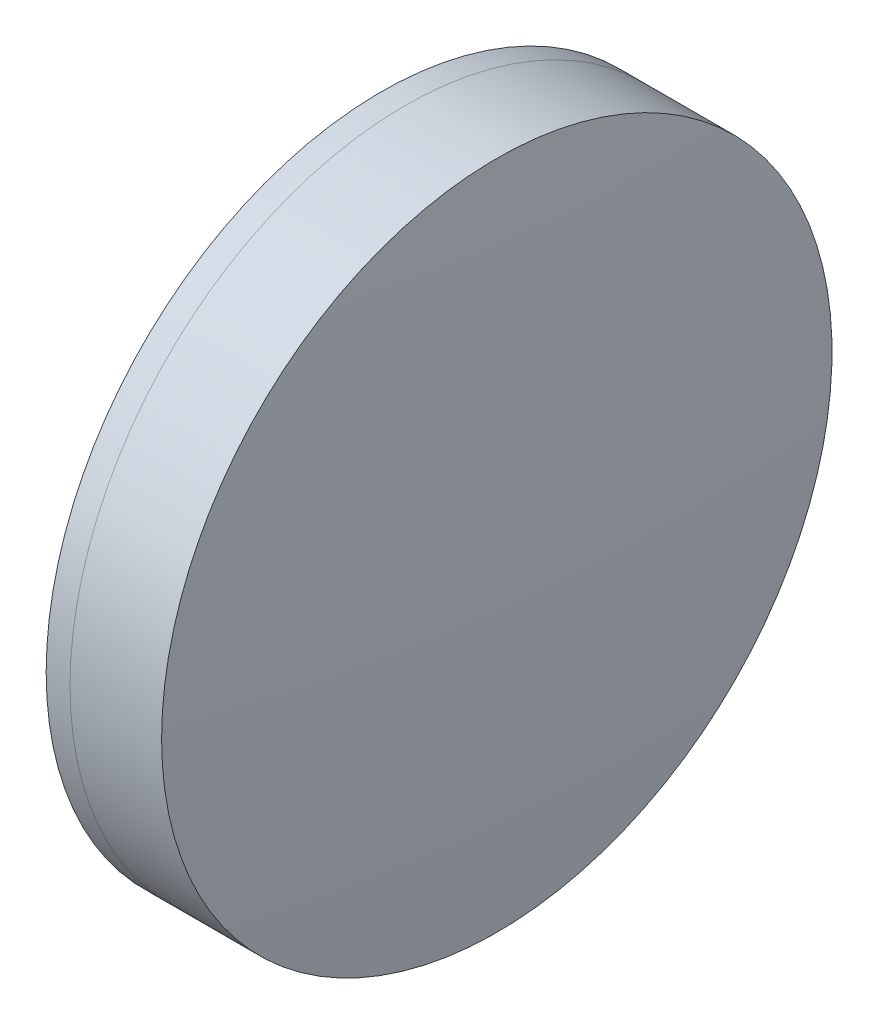
ISO-10303-21;
HEADER;
FILE_DESCRIPTION(('STEP AP214'),'2;1');
FILE_NAME('part.step','',(''),(''),'','','');
FILE_SCHEMA(('AUTOMOTIVE_DESIGN { 1 0 10303 214 1 1 1 1 }'));
ENDSEC;
DATA;
#1=APPLICATION_CONTEXT('core data for automotive mechanical design processes');
#2=APPLICATION_PROTOCOL_DEFINITION('international standard','automotive_design',2000,#1);
#3=PRODUCT_CONTEXT('',#1,'mechanical');
#4=PRODUCT('Part','Part','',(#3));
#5=PRODUCT_RELATED_PRODUCT_CATEGORY('part','',(#4));
#6=PRODUCT_DEFINITION_FORMATION('','',#4);
#7=PRODUCT_DEFINITION_CONTEXT('part definition',#1,'design');
#8=PRODUCT_DEFINITION('design','',#6,#7);
#9=PRODUCT_DEFINITION_SHAPE('','',#8);
#10=(LENGTH_UNIT() NAMED_UNIT(*) SI_UNIT(.MILLI.,.METRE.));
#11=(NAMED_UNIT(*) PLANE_ANGLE_UNIT() SI_UNIT($,.RADIAN.));
#12=(NAMED_UNIT(*) SI_UNIT($,.STERADIAN.) SOLID_ANGLE_UNIT());
#13=UNCERTAINTY_MEASURE_WITH_UNIT(LENGTH_MEASURE(1.E-05),#10,'distance_accuracy_value','');
#14=(GEOMETRIC_REPRESENTATION_CONTEXT(3) GLOBAL_UNCERTAINTY_ASSIGNED_CONTEXT((#13)) GLOBAL_UNIT_ASSIGNED_CONTEXT((#10,
#11,#12)) REPRESENTATION_CONTEXT('',''));
#15=CARTESIAN_POINT('',(0.,0.,0.));
#16=DIRECTION('',(0.,0.,1.));
#17=DIRECTION('',(1.,0.,0.));
#18=AXIS2_PLACEMENT_3D('',#15,#16,#17);
#19=CARTESIAN_POINT('',(486.158436508957,0.,0.));
#20=DIRECTION('',(-1.,0.,0.));
#21=DIRECTION('',(0.,0.,1.));
#22=AXIS2_PLACEMENT_3D('',#19,#20,#21);
#23=SPHERICAL_SURFACE('',#22,56.);
#24=CARTESIAN_POINT('',(536.066752449289,0.,0.));
#25=DIRECTION('',(-1.,0.,0.));
#26=DIRECTION('',(0.,0.,1.));
#27=AXIS2_PLACEMENT_3D('',#24,#25,#26);
#28=CIRCLE('',#27,25.4000000000001);
#29=CARTESIAN_POINT('',(536.066752449289,0.,25.4000000000001));
#30=VERTEX_POINT('',#29);
#31=EDGE_CURVE('E11',#30,#30,#28,.T.);
#32=ORIENTED_EDGE('',*,*,#31,.T.);
#33=EDGE_LOOP('',(#32));
#34=FACE_BOUND('',#33,.T.);
#35=ADVANCED_FACE('F45',(#34),#23,.F.);
#36=CARTESIAN_POINT('',(-0.551919992657797,0.,0.));
#37=DIRECTION('',(-1.,0.,0.));
#38=DIRECTION('',(0.,0.,1.));
#39=AXIS2_PLACEMENT_3D('',#36,#37,#38);
#40=CYLINDRICAL_SURFACE('',#39,25.4000000000001);
#41=CARTESIAN_POINT('',(543.006463877195,0.,0.));
#42=DIRECTION('',(-1.,0.,0.));
#43=DIRECTION('',(0.,0.,1.));
#44=AXIS2_PLACEMENT_3D('',#41,#42,#43);
#45=CIRCLE('',#44,25.4000000000001);
#46=CARTESIAN_POINT('',(543.006463877195,0.,25.4000000000001));
#47=VERTEX_POINT('',#46);
#48=EDGE_CURVE('E51',#47,#47,#45,.T.);
#49=ORIENTED_EDGE('',*,*,#48,.T.);
#50=EDGE_LOOP('',(#49));
#51=FACE_BOUND('',#50,.T.);
#52=ORIENTED_EDGE('',*,*,#31,.F.);
#53=EDGE_LOOP('',(#52));
#54=FACE_BOUND('',#53,.T.);
#55=ADVANCED_FACE('F57',(#51,#54),#40,.T.);
#56=CARTESIAN_POINT('',(263.558436508957,0.,0.));
#57=DIRECTION('',(-1.,0.,0.));
#58=DIRECTION('',(0.,0.,1.));
#59=AXIS2_PLACEMENT_3D('',#56,#57,#58);
#60=SPHERICAL_SURFACE('',#59,280.6);
#61=ORIENTED_EDGE('',*,*,#48,.F.);
#62=EDGE_LOOP('',(#61));
#63=FACE_BOUND('',#62,.T.);
#64=ADVANCED_FACE('F60',(#63),#60,.T.);
#65=CLOSED_SHELL('',(#35,#55,#64));
#66=MANIFOLD_SOLID_BREP('B2',#65);
#67=CARTESIAN_POINT('',(594.958436508957,0.,0.));
#68=DIRECTION('',(-1.,0.,0.));
#69=DIRECTION('',(0.,0.,1.));
#70=AXIS2_PLACEMENT_3D('',#67,#68,#69);
#71=SPHERICAL_SURFACE('',#70,65.8000000000001);
#72=CARTESIAN_POINT('',(534.258518881335,0.,0.));
#73=DIRECTION('',(-1.,0.,0.));
#74=DIRECTION('',(0.,0.,1.));
#75=AXIS2_PLACEMENT_3D('',#72,#73,#74);
#76=CIRCLE('',#75,25.4);
#77=CARTESIAN_POINT('',(534.258518881335,0.,25.4));
#78=VERTEX_POINT('',#77);
#79=EDGE_CURVE('E44',#78,#78,#76,.T.);
#80=ORIENTED_EDGE('',*,*,#79,.T.);
#81=EDGE_LOOP('',(#80));
#82=FACE_BOUND('',#81,.T.);
#83=ADVANCED_FACE('F86',(#82),#71,.T.);
#84=CARTESIAN_POINT('',(124.523309526045,0.,0.));
#85=DIRECTION('',(-1.,0.,0.));
#86=DIRECTION('',(0.,0.,1.));
#87=AXIS2_PLACEMENT_3D('',#84,#85,#86);
#88=CYLINDRICAL_SURFACE('',#87,25.4);
#89=CARTESIAN_POINT('',(536.066752449289,0.,0.));
#90=DIRECTION('',(-1.,0.,0.));
#91=DIRECTION('',(0.,0.,1.));
#92=AXIS2_PLACEMENT_3D('',#89,#90,#91);
#93=CIRCLE('',#92,25.4);
#94=CARTESIAN_POINT('',(536.066752449289,0.,25.4));
#95=VERTEX_POINT('',#94);
#96=EDGE_CURVE('E92',#95,#95,#93,.T.);
#97=ORIENTED_EDGE('',*,*,#96,.T.);
#98=EDGE_LOOP('',(#97));
#99=FACE_BOUND('',#98,.T.);
#100=ORIENTED_EDGE('',*,*,#79,.F.);
#101=EDGE_LOOP('',(#100));
#102=FACE_BOUND('',#101,.T.);
#103=ADVANCED_FACE('F98',(#99,#102),#88,.T.);
#104=CARTESIAN_POINT('',(486.158436508957,0.,0.));
#105=DIRECTION('',(-1.,0.,0.));
#106=DIRECTION('',(0.,0.,1.));
#107=AXIS2_PLACEMENT_3D('',#104,#105,#106);
#108=SPHERICAL_SURFACE('',#107,56.);
#109=ORIENTED_EDGE('',*,*,#96,.F.);
#110=EDGE_LOOP('',(#109));
#111=FACE_BOUND('',#110,.T.);
#112=ADVANCED_FACE('F101',(#111),#108,.T.);
#113=CLOSED_SHELL('',(#83,#103,#112));
#114=MANIFOLD_SOLID_BREP('B6',#113);
#115=ADVANCED_BREP_SHAPE_REPRESENTATION('',(#18,#66,#114),#14);
#116=SHAPE_DEFINITION_REPRESENTATION(#9,#115);
ENDSEC;
END-ISO-10303-21;
